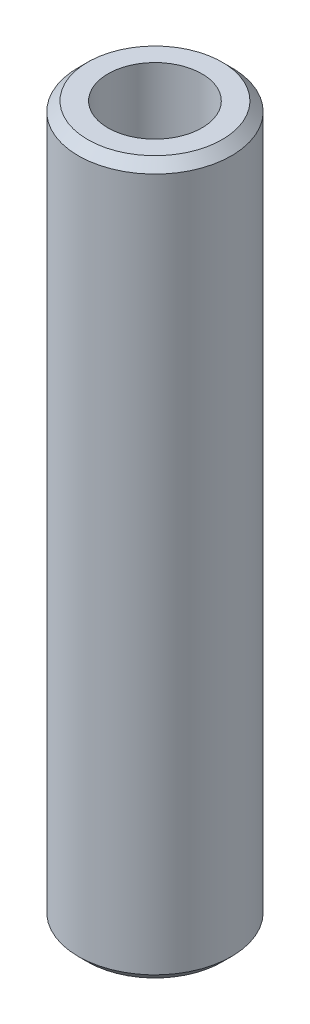
ISO-10303-21;
HEADER;
FILE_DESCRIPTION(('STEP AP214'),'2;1');
FILE_NAME('part.step','',(''),(''),'','','');
FILE_SCHEMA(('AUTOMOTIVE_DESIGN { 1 0 10303 214 1 1 1 1 }'));
ENDSEC;
DATA;
#1=APPLICATION_CONTEXT('core data for automotive mechanical design processes');
#2=APPLICATION_PROTOCOL_DEFINITION('international standard','automotive_design',2000,#1);
#3=PRODUCT_CONTEXT('',#1,'mechanical');
#4=PRODUCT('Part','Part','',(#3));
#5=PRODUCT_RELATED_PRODUCT_CATEGORY('part','',(#4));
#6=PRODUCT_DEFINITION_FORMATION('','',#4);
#7=PRODUCT_DEFINITION_CONTEXT('part definition',#1,'design');
#8=PRODUCT_DEFINITION('design','',#6,#7);
#9=PRODUCT_DEFINITION_SHAPE('','',#8);
#10=(LENGTH_UNIT() NAMED_UNIT(*) SI_UNIT(.MILLI.,.METRE.));
#11=(NAMED_UNIT(*) PLANE_ANGLE_UNIT() SI_UNIT($,.RADIAN.));
#12=(NAMED_UNIT(*) SI_UNIT($,.STERADIAN.) SOLID_ANGLE_UNIT());
#13=UNCERTAINTY_MEASURE_WITH_UNIT(LENGTH_MEASURE(1.E-05),#10,'distance_accuracy_value','');
#14=(GEOMETRIC_REPRESENTATION_CONTEXT(3) GLOBAL_UNCERTAINTY_ASSIGNED_CONTEXT((#13)) GLOBAL_UNIT_ASSIGNED_CONTEXT((#10,
#11,#12)) REPRESENTATION_CONTEXT('',''));
#15=CARTESIAN_POINT('',(0.,0.,0.));
#16=DIRECTION('',(0.,0.,1.));
#17=DIRECTION('',(1.,0.,0.));
#18=AXIS2_PLACEMENT_3D('',#15,#16,#17);
#19=CARTESIAN_POINT('',(0.,139.575108071361,0.));
#20=DIRECTION('',(0.,-1.,0.));
#21=DIRECTION('',(0.,0.,-1.));
#22=AXIS2_PLACEMENT_3D('',#19,#20,#21);
#23=CYLINDRICAL_SURFACE('',#22,15.);
#24=CARTESIAN_POINT('',(0.,137.743264571718,0.));
#25=DIRECTION('',(0.,1.,0.));
#26=DIRECTION('',(0.,0.,1.));
#27=AXIS2_PLACEMENT_3D('',#24,#25,#26);
#28=CIRCLE('',#27,15.);
#29=CARTESIAN_POINT('',(0.,137.743264571718,15.));
#30=VERTEX_POINT('',#29);
#31=EDGE_CURVE('E50',#30,#30,#28,.F.);
#32=ORIENTED_EDGE('',*,*,#31,.T.);
#33=EDGE_LOOP('',(#32));
#34=FACE_BOUND('',#33,.T.);
#35=CARTESIAN_POINT('',(0.,1.83184349964324,0.));
#36=DIRECTION('',(0.,1.,0.));
#37=DIRECTION('',(0.,0.,1.));
#38=AXIS2_PLACEMENT_3D('',#35,#36,#37);
#39=CIRCLE('',#38,15.);
#40=CARTESIAN_POINT('',(0.,1.83184349964324,15.));
#41=VERTEX_POINT('',#40);
#42=EDGE_CURVE('E51',#41,#41,#39,.T.);
#43=ORIENTED_EDGE('',*,*,#42,.T.);
#44=EDGE_LOOP('',(#43));
#45=FACE_BOUND('',#44,.T.);
#46=ADVANCED_FACE('F39',(#34,#45),#23,.T.);
#47=CARTESIAN_POINT('',(0.,139.575108071361,0.));
#48=DIRECTION('',(0.,1.,0.));
#49=DIRECTION('',(0.,0.,1.));
#50=AXIS2_PLACEMENT_3D('',#47,#48,#49);
#51=PLANE('',#50);
#52=CARTESIAN_POINT('',(0.,139.575108071361,0.));
#53=DIRECTION('',(0.,1.,0.));
#54=DIRECTION('',(0.,0.,1.));
#55=AXIS2_PLACEMENT_3D('',#52,#53,#54);
#56=CIRCLE('',#55,13.1681565003568);
#57=CARTESIAN_POINT('',(0.,139.575108071361,13.1681565003568));
#58=VERTEX_POINT('',#57);
#59=EDGE_CURVE('E54',#58,#58,#56,.T.);
#60=ORIENTED_EDGE('',*,*,#59,.T.);
#61=EDGE_LOOP('',(#60));
#62=FACE_BOUND('',#61,.T.);
#63=CARTESIAN_POINT('',(0.,139.575108071361,0.));
#64=DIRECTION('',(0.,1.,0.));
#65=DIRECTION('',(0.,0.,1.));
#66=AXIS2_PLACEMENT_3D('',#63,#64,#65);
#67=CIRCLE('',#66,9.20072540281108);
#68=CARTESIAN_POINT('',(0.,139.575108071361,9.20072540281108));
#69=VERTEX_POINT('',#68);
#70=EDGE_CURVE('E58',#69,#69,#67,.T.);
#71=ORIENTED_EDGE('',*,*,#70,.F.);
#72=EDGE_LOOP('',(#71));
#73=FACE_BOUND('',#72,.T.);
#74=ADVANCED_FACE('F69',(#62,#73),#51,.T.);
#75=CARTESIAN_POINT('',(0.,0.,0.));
#76=DIRECTION('',(0.,1.,0.));
#77=DIRECTION('',(0.,0.,1.));
#78=AXIS2_PLACEMENT_3D('',#75,#76,#77);
#79=PLANE('',#78);
#80=CARTESIAN_POINT('',(0.,0.,0.));
#81=DIRECTION('',(0.,1.,0.));
#82=DIRECTION('',(0.,0.,1.));
#83=AXIS2_PLACEMENT_3D('',#80,#81,#82);
#84=CIRCLE('',#83,13.1681565003568);
#85=CARTESIAN_POINT('',(0.,0.,13.1681565003568));
#86=VERTEX_POINT('',#85);
#87=EDGE_CURVE('E10',#86,#86,#84,.F.);
#88=ORIENTED_EDGE('',*,*,#87,.T.);
#89=EDGE_LOOP('',(#88));
#90=FACE_BOUND('',#89,.T.);
#91=CARTESIAN_POINT('',(0.,0.,0.));
#92=DIRECTION('',(0.,1.,0.));
#93=DIRECTION('',(0.,0.,1.));
#94=AXIS2_PLACEMENT_3D('',#91,#92,#93);
#95=CIRCLE('',#94,9.20072540281108);
#96=CARTESIAN_POINT('',(0.,0.,9.20072540281108));
#97=VERTEX_POINT('',#96);
#98=EDGE_CURVE('E63',#97,#97,#95,.T.);
#99=ORIENTED_EDGE('',*,*,#98,.T.);
#100=EDGE_LOOP('',(#99));
#101=FACE_BOUND('',#100,.T.);
#102=ADVANCED_FACE('F75',(#90,#101),#79,.F.);
#103=CARTESIAN_POINT('',(0.,139.575108071361,0.));
#104=DIRECTION('',(0.,-1.,0.));
#105=DIRECTION('',(0.,0.,-1.));
#106=AXIS2_PLACEMENT_3D('',#103,#104,#105);
#107=CYLINDRICAL_SURFACE('',#106,9.20072540281108);
#108=ORIENTED_EDGE('',*,*,#70,.T.);
#109=EDGE_LOOP('',(#108));
#110=FACE_BOUND('',#109,.T.);
#111=ORIENTED_EDGE('',*,*,#98,.F.);
#112=EDGE_LOOP('',(#111));
#113=FACE_BOUND('',#112,.T.);
#114=ADVANCED_FACE('F70',(#110,#113),#107,.F.);
#115=CARTESIAN_POINT('',(0.,139.575108071361,0.));
#116=DIRECTION('',(0.,-1.,0.));
#117=DIRECTION('',(0.,0.,-1.));
#118=AXIS2_PLACEMENT_3D('',#115,#116,#117);
#119=CONICAL_SURFACE('',#118,13.1681565003568,0.785398163397445);
#120=ORIENTED_EDGE('',*,*,#31,.F.);
#121=EDGE_LOOP('',(#120));
#122=FACE_BOUND('',#121,.T.);
#123=ORIENTED_EDGE('',*,*,#59,.F.);
#124=EDGE_LOOP('',(#123));
#125=FACE_BOUND('',#124,.T.);
#126=ADVANCED_FACE('F81',(#122,#125),#119,.T.);
#127=CARTESIAN_POINT('',(0.,1.83184349964324,0.));
#128=DIRECTION('',(0.,1.,0.));
#129=DIRECTION('',(0.,0.,1.));
#130=AXIS2_PLACEMENT_3D('',#127,#128,#129);
#131=CONICAL_SURFACE('',#130,15.,0.785398163397448);
#132=ORIENTED_EDGE('',*,*,#87,.F.);
#133=EDGE_LOOP('',(#132));
#134=FACE_BOUND('',#133,.T.);
#135=ORIENTED_EDGE('',*,*,#42,.F.);
#136=EDGE_LOOP('',(#135));
#137=FACE_BOUND('',#136,.T.);
#138=ADVANCED_FACE('F45',(#134,#137),#131,.T.);
#139=CLOSED_SHELL('',(#46,#74,#102,#114,#126,#138));
#140=MANIFOLD_SOLID_BREP('B2',#139);
#141=ADVANCED_BREP_SHAPE_REPRESENTATION('',(#18,#140),#14);
#142=SHAPE_DEFINITION_REPRESENTATION(#9,#141);
ENDSEC;
END-ISO-10303-21;
